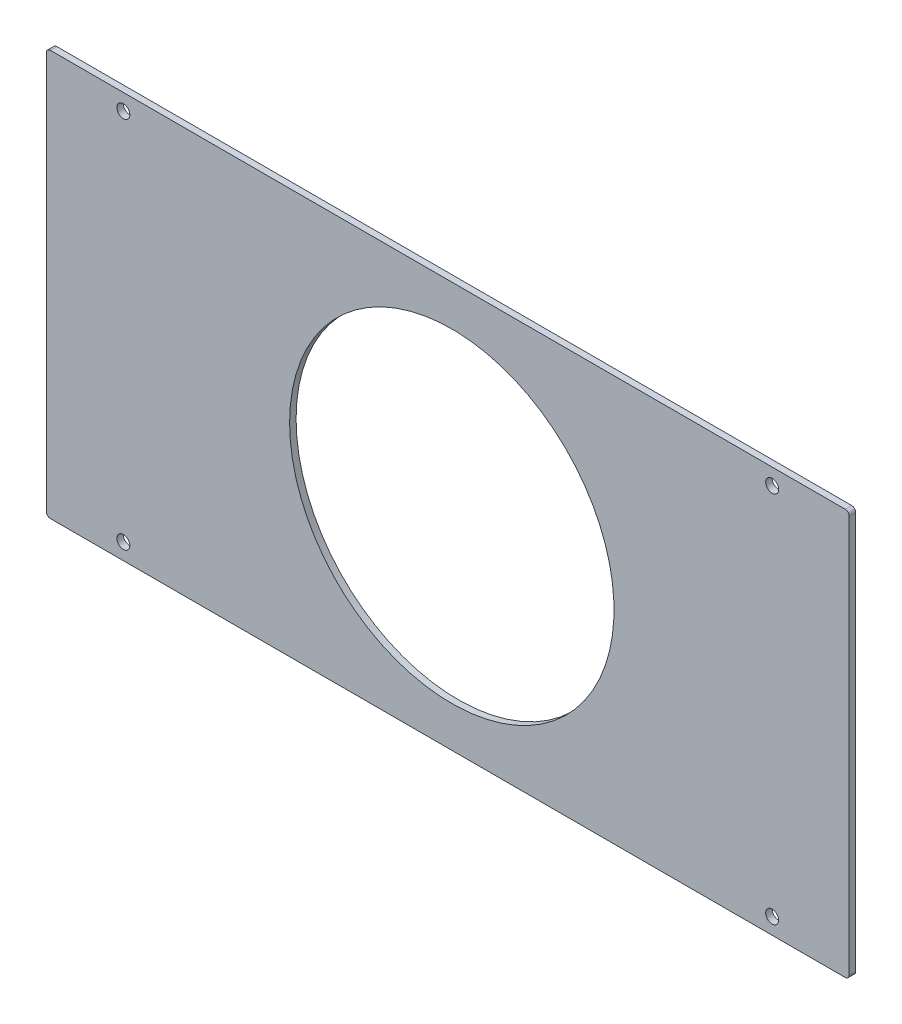
ISO-10303-21;
HEADER;
FILE_DESCRIPTION(('STEP AP214'),'2;1');
FILE_NAME('part.step','',(''),(''),'','','');
FILE_SCHEMA(('AUTOMOTIVE_DESIGN { 1 0 10303 214 1 1 1 1 }'));
ENDSEC;
DATA;
#1=APPLICATION_CONTEXT('core data for automotive mechanical design processes');
#2=APPLICATION_PROTOCOL_DEFINITION('international standard','automotive_design',2000,#1);
#3=PRODUCT_CONTEXT('',#1,'mechanical');
#4=PRODUCT('Part','Part','',(#3));
#5=PRODUCT_RELATED_PRODUCT_CATEGORY('part','',(#4));
#6=PRODUCT_DEFINITION_FORMATION('','',#4);
#7=PRODUCT_DEFINITION_CONTEXT('part definition',#1,'design');
#8=PRODUCT_DEFINITION('design','',#6,#7);
#9=PRODUCT_DEFINITION_SHAPE('','',#8);
#10=(LENGTH_UNIT() NAMED_UNIT(*) SI_UNIT(.MILLI.,.METRE.));
#11=(NAMED_UNIT(*) PLANE_ANGLE_UNIT() SI_UNIT($,.RADIAN.));
#12=(NAMED_UNIT(*) SI_UNIT($,.STERADIAN.) SOLID_ANGLE_UNIT());
#13=UNCERTAINTY_MEASURE_WITH_UNIT(LENGTH_MEASURE(1.E-05),#10,'distance_accuracy_value','');
#14=(GEOMETRIC_REPRESENTATION_CONTEXT(3) GLOBAL_UNCERTAINTY_ASSIGNED_CONTEXT((#13)) GLOBAL_UNIT_ASSIGNED_CONTEXT((#10,
#11,#12)) REPRESENTATION_CONTEXT('',''));
#15=CARTESIAN_POINT('',(0.,0.,0.));
#16=DIRECTION('',(0.,0.,1.));
#17=DIRECTION('',(1.,0.,0.));
#18=AXIS2_PLACEMENT_3D('',#15,#16,#17);
#19=CARTESIAN_POINT('',(197.,99.,1.6));
#20=DIRECTION('',(0.,0.,-1.));
#21=DIRECTION('',(-1.,0.,0.));
#22=AXIS2_PLACEMENT_3D('',#19,#20,#21);
#23=CYLINDRICAL_SURFACE('',#22,1.);
#24=CARTESIAN_POINT('',(197.,99.,0.));
#25=DIRECTION('',(0.,0.,1.));
#26=DIRECTION('',(-1.,0.,0.));
#27=AXIS2_PLACEMENT_3D('',#24,#25,#26);
#28=CIRCLE('',#27,1.);
#29=CARTESIAN_POINT('',(198.,99.,0.));
#30=VERTEX_POINT('',#29);
#31=CARTESIAN_POINT('',(197.,100.,0.));
#32=VERTEX_POINT('',#31);
#33=EDGE_CURVE('E132',#30,#32,#28,.T.);
#34=ORIENTED_EDGE('',*,*,#33,.T.);
#35=DIRECTION('',(0.,0.,-1.));
#36=VECTOR('',#35,1.);
#37=CARTESIAN_POINT('',(197.,100.,1.6));
#38=LINE('',#37,#36);
#39=CARTESIAN_POINT('',(197.,100.,1.6));
#40=VERTEX_POINT('',#39);
#41=EDGE_CURVE('E11',#40,#32,#38,.T.);
#42=ORIENTED_EDGE('',*,*,#41,.F.);
#43=CARTESIAN_POINT('',(197.,99.,1.6));
#44=DIRECTION('',(0.,0.,1.));
#45=DIRECTION('',(-1.,0.,0.));
#46=AXIS2_PLACEMENT_3D('',#43,#44,#45);
#47=CIRCLE('',#46,1.);
#48=CARTESIAN_POINT('',(198.,99.,1.6));
#49=VERTEX_POINT('',#48);
#50=EDGE_CURVE('E147',#49,#40,#47,.T.);
#51=ORIENTED_EDGE('',*,*,#50,.F.);
#52=DIRECTION('',(0.,0.,-1.));
#53=VECTOR('',#52,1.);
#54=CARTESIAN_POINT('',(198.,99.,1.6));
#55=LINE('',#54,#53);
#56=EDGE_CURVE('E128',#49,#30,#55,.T.);
#57=ORIENTED_EDGE('',*,*,#56,.T.);
#58=EDGE_LOOP('',(#34,#42,#51,#57));
#59=FACE_BOUND('',#58,.T.);
#60=ADVANCED_FACE('F36',(#59),#23,.T.);
#61=CARTESIAN_POINT('',(1.00000000000001,100.,1.6));
#62=DIRECTION('',(0.,-1.,0.));
#63=DIRECTION('',(0.,0.,-1.));
#64=AXIS2_PLACEMENT_3D('',#61,#62,#63);
#65=PLANE('',#64);
#66=DIRECTION('',(-1.,0.,0.));
#67=VECTOR('',#66,1.);
#68=CARTESIAN_POINT('',(1.00000000000001,100.,0.));
#69=LINE('',#68,#67);
#70=CARTESIAN_POINT('',(1.00000000000001,100.,0.));
#71=VERTEX_POINT('',#70);
#72=EDGE_CURVE('E135',#32,#71,#69,.T.);
#73=ORIENTED_EDGE('',*,*,#72,.T.);
#74=DIRECTION('',(0.,0.,-1.));
#75=VECTOR('',#74,1.);
#76=CARTESIAN_POINT('',(1.00000000000001,100.,1.6));
#77=LINE('',#76,#75);
#78=CARTESIAN_POINT('',(1.00000000000001,100.,1.6));
#79=VERTEX_POINT('',#78);
#80=EDGE_CURVE('E44',#79,#71,#77,.T.);
#81=ORIENTED_EDGE('',*,*,#80,.F.);
#82=DIRECTION('',(-1.,0.,0.));
#83=VECTOR('',#82,1.);
#84=CARTESIAN_POINT('',(1.00000000000001,100.,1.6));
#85=LINE('',#84,#83);
#86=EDGE_CURVE('E95',#40,#79,#85,.T.);
#87=ORIENTED_EDGE('',*,*,#86,.F.);
#88=ORIENTED_EDGE('',*,*,#41,.T.);
#89=EDGE_LOOP('',(#73,#81,#87,#88));
#90=FACE_BOUND('',#89,.T.);
#91=ADVANCED_FACE('F235',(#90),#65,.F.);
#92=CARTESIAN_POINT('',(1.,99.,1.6));
#93=DIRECTION('',(0.,0.,-1.));
#94=DIRECTION('',(-1.,0.,0.));
#95=AXIS2_PLACEMENT_3D('',#92,#93,#94);
#96=CYLINDRICAL_SURFACE('',#95,1.);
#97=CARTESIAN_POINT('',(1.,99.,0.));
#98=DIRECTION('',(0.,0.,1.));
#99=DIRECTION('',(-1.,0.,0.));
#100=AXIS2_PLACEMENT_3D('',#97,#98,#99);
#101=CIRCLE('',#100,1.);
#102=CARTESIAN_POINT('',(0.,99.,0.));
#103=VERTEX_POINT('',#102);
#104=EDGE_CURVE('E138',#71,#103,#101,.T.);
#105=ORIENTED_EDGE('',*,*,#104,.T.);
#106=DIRECTION('',(0.,0.,-1.));
#107=VECTOR('',#106,1.);
#108=CARTESIAN_POINT('',(0.,99.,1.6));
#109=LINE('',#108,#107);
#110=CARTESIAN_POINT('',(0.,99.,1.6));
#111=VERTEX_POINT('',#110);
#112=EDGE_CURVE('E154',#111,#103,#109,.T.);
#113=ORIENTED_EDGE('',*,*,#112,.F.);
#114=CARTESIAN_POINT('',(1.,99.,1.6));
#115=DIRECTION('',(0.,0.,1.));
#116=DIRECTION('',(-1.,0.,0.));
#117=AXIS2_PLACEMENT_3D('',#114,#115,#116);
#118=CIRCLE('',#117,1.);
#119=EDGE_CURVE('E162',#79,#111,#118,.T.);
#120=ORIENTED_EDGE('',*,*,#119,.F.);
#121=ORIENTED_EDGE('',*,*,#80,.T.);
#122=EDGE_LOOP('',(#105,#113,#120,#121));
#123=FACE_BOUND('',#122,.T.);
#124=ADVANCED_FACE('F160',(#123),#96,.T.);
#125=CARTESIAN_POINT('',(0.,1.00000000000001,1.6));
#126=DIRECTION('',(1.,0.,0.));
#127=DIRECTION('',(0.,0.,-1.));
#128=AXIS2_PLACEMENT_3D('',#125,#126,#127);
#129=PLANE('',#128);
#130=DIRECTION('',(0.,-1.,0.));
#131=VECTOR('',#130,1.);
#132=CARTESIAN_POINT('',(0.,1.00000000000001,0.));
#133=LINE('',#132,#131);
#134=CARTESIAN_POINT('',(0.,1.00000000000001,0.));
#135=VERTEX_POINT('',#134);
#136=EDGE_CURVE('E140',#103,#135,#133,.T.);
#137=ORIENTED_EDGE('',*,*,#136,.T.);
#138=DIRECTION('',(0.,0.,-1.));
#139=VECTOR('',#138,1.);
#140=CARTESIAN_POINT('',(0.,1.00000000000001,1.6));
#141=LINE('',#140,#139);
#142=CARTESIAN_POINT('',(0.,1.00000000000001,1.6));
#143=VERTEX_POINT('',#142);
#144=EDGE_CURVE('E151',#143,#135,#141,.T.);
#145=ORIENTED_EDGE('',*,*,#144,.F.);
#146=DIRECTION('',(0.,-1.,0.));
#147=VECTOR('',#146,1.);
#148=CARTESIAN_POINT('',(0.,1.00000000000001,1.6));
#149=LINE('',#148,#147);
#150=EDGE_CURVE('E174',#111,#143,#149,.T.);
#151=ORIENTED_EDGE('',*,*,#150,.F.);
#152=ORIENTED_EDGE('',*,*,#112,.T.);
#153=EDGE_LOOP('',(#137,#145,#151,#152));
#154=FACE_BOUND('',#153,.T.);
#155=ADVANCED_FACE('F170',(#154),#129,.F.);
#156=CARTESIAN_POINT('',(1.,1.,1.6));
#157=DIRECTION('',(0.,0.,-1.));
#158=DIRECTION('',(-1.,0.,0.));
#159=AXIS2_PLACEMENT_3D('',#156,#157,#158);
#160=CYLINDRICAL_SURFACE('',#159,1.);
#161=CARTESIAN_POINT('',(1.,1.,0.));
#162=DIRECTION('',(0.,0.,1.));
#163=DIRECTION('',(-1.,0.,0.));
#164=AXIS2_PLACEMENT_3D('',#161,#162,#163);
#165=CIRCLE('',#164,1.);
#166=CARTESIAN_POINT('',(1.00000000000001,0.,0.));
#167=VERTEX_POINT('',#166);
#168=EDGE_CURVE('E142',#135,#167,#165,.T.);
#169=ORIENTED_EDGE('',*,*,#168,.T.);
#170=DIRECTION('',(0.,0.,-1.));
#171=VECTOR('',#170,1.);
#172=CARTESIAN_POINT('',(1.00000000000001,0.,1.6));
#173=LINE('',#172,#171);
#174=CARTESIAN_POINT('',(1.00000000000001,0.,1.6));
#175=VERTEX_POINT('',#174);
#176=EDGE_CURVE('E123',#175,#167,#173,.T.);
#177=ORIENTED_EDGE('',*,*,#176,.F.);
#178=CARTESIAN_POINT('',(1.,1.,1.6));
#179=DIRECTION('',(0.,0.,1.));
#180=DIRECTION('',(-1.,0.,0.));
#181=AXIS2_PLACEMENT_3D('',#178,#179,#180);
#182=CIRCLE('',#181,1.);
#183=EDGE_CURVE('E114',#143,#175,#182,.T.);
#184=ORIENTED_EDGE('',*,*,#183,.F.);
#185=ORIENTED_EDGE('',*,*,#144,.T.);
#186=EDGE_LOOP('',(#169,#177,#184,#185));
#187=FACE_BOUND('',#186,.T.);
#188=ADVANCED_FACE('F173',(#187),#160,.T.);
#189=CARTESIAN_POINT('',(1.00000000000001,0.,1.6));
#190=DIRECTION('',(0.,1.,0.));
#191=DIRECTION('',(0.,0.,1.));
#192=AXIS2_PLACEMENT_3D('',#189,#190,#191);
#193=PLANE('',#192);
#194=DIRECTION('',(1.,0.,0.));
#195=VECTOR('',#194,1.);
#196=CARTESIAN_POINT('',(1.00000000000001,0.,0.));
#197=LINE('',#196,#195);
#198=CARTESIAN_POINT('',(197.,0.,0.));
#199=VERTEX_POINT('',#198);
#200=EDGE_CURVE('E122',#167,#199,#197,.T.);
#201=ORIENTED_EDGE('',*,*,#200,.T.);
#202=DIRECTION('',(0.,0.,-1.));
#203=VECTOR('',#202,1.);
#204=CARTESIAN_POINT('',(197.,0.,1.6));
#205=LINE('',#204,#203);
#206=CARTESIAN_POINT('',(197.,0.,1.6));
#207=VERTEX_POINT('',#206);
#208=EDGE_CURVE('E119',#207,#199,#205,.T.);
#209=ORIENTED_EDGE('',*,*,#208,.F.);
#210=DIRECTION('',(1.,0.,0.));
#211=VECTOR('',#210,1.);
#212=CARTESIAN_POINT('',(1.00000000000001,0.,1.6));
#213=LINE('',#212,#211);
#214=EDGE_CURVE('E108',#175,#207,#213,.T.);
#215=ORIENTED_EDGE('',*,*,#214,.F.);
#216=ORIENTED_EDGE('',*,*,#176,.T.);
#217=EDGE_LOOP('',(#201,#209,#215,#216));
#218=FACE_BOUND('',#217,.T.);
#219=ADVANCED_FACE('F120',(#218),#193,.F.);
#220=CARTESIAN_POINT('',(197.,1.,1.6));
#221=DIRECTION('',(0.,0.,-1.));
#222=DIRECTION('',(-1.,0.,0.));
#223=AXIS2_PLACEMENT_3D('',#220,#221,#222);
#224=CYLINDRICAL_SURFACE('',#223,1.);
#225=CARTESIAN_POINT('',(197.,1.,0.));
#226=DIRECTION('',(0.,0.,1.));
#227=DIRECTION('',(1.,0.,0.));
#228=AXIS2_PLACEMENT_3D('',#225,#226,#227);
#229=CIRCLE('',#228,1.);
#230=CARTESIAN_POINT('',(198.,1.,0.));
#231=VERTEX_POINT('',#230);
#232=EDGE_CURVE('E81',#199,#231,#229,.T.);
#233=ORIENTED_EDGE('',*,*,#232,.T.);
#234=DIRECTION('',(0.,0.,-1.));
#235=VECTOR('',#234,1.);
#236=CARTESIAN_POINT('',(198.,1.,1.6));
#237=LINE('',#236,#235);
#238=CARTESIAN_POINT('',(198.,1.,1.6));
#239=VERTEX_POINT('',#238);
#240=EDGE_CURVE('E124',#239,#231,#237,.T.);
#241=ORIENTED_EDGE('',*,*,#240,.F.);
#242=CARTESIAN_POINT('',(197.,1.,1.6));
#243=DIRECTION('',(0.,0.,1.));
#244=DIRECTION('',(1.,0.,0.));
#245=AXIS2_PLACEMENT_3D('',#242,#243,#244);
#246=CIRCLE('',#245,1.);
#247=EDGE_CURVE('E112',#207,#239,#246,.T.);
#248=ORIENTED_EDGE('',*,*,#247,.F.);
#249=ORIENTED_EDGE('',*,*,#208,.T.);
#250=EDGE_LOOP('',(#233,#241,#248,#249));
#251=FACE_BOUND('',#250,.T.);
#252=ADVANCED_FACE('F126',(#251),#224,.T.);
#253=CARTESIAN_POINT('',(198.,1.,1.6));
#254=DIRECTION('',(-1.,0.,0.));
#255=DIRECTION('',(0.,0.,1.));
#256=AXIS2_PLACEMENT_3D('',#253,#254,#255);
#257=PLANE('',#256);
#258=DIRECTION('',(0.,1.,0.));
#259=VECTOR('',#258,1.);
#260=CARTESIAN_POINT('',(198.,1.,0.));
#261=LINE('',#260,#259);
#262=EDGE_CURVE('E87',#231,#30,#261,.T.);
#263=ORIENTED_EDGE('',*,*,#262,.T.);
#264=ORIENTED_EDGE('',*,*,#56,.F.);
#265=DIRECTION('',(0.,1.,0.));
#266=VECTOR('',#265,1.);
#267=CARTESIAN_POINT('',(198.,1.,1.6));
#268=LINE('',#267,#266);
#269=EDGE_CURVE('E52',#239,#49,#268,.T.);
#270=ORIENTED_EDGE('',*,*,#269,.F.);
#271=ORIENTED_EDGE('',*,*,#240,.T.);
#272=EDGE_LOOP('',(#263,#264,#270,#271));
#273=FACE_BOUND('',#272,.T.);
#274=ADVANCED_FACE('F242',(#273),#257,.F.);
#275=CARTESIAN_POINT('',(197.,99.,1.6));
#276=DIRECTION('',(0.,0.,-1.));
#277=DIRECTION('',(-1.,0.,0.));
#278=AXIS2_PLACEMENT_3D('',#275,#276,#277);
#279=PLANE('',#278);
#280=CARTESIAN_POINT('',(100.,50.,1.6));
#281=DIRECTION('',(0.,0.,-1.));
#282=DIRECTION('',(-1.,0.,0.));
#283=AXIS2_PLACEMENT_3D('',#280,#281,#282);
#284=CIRCLE('',#283,40.);
#285=CARTESIAN_POINT('',(60.,50.,1.6));
#286=VERTEX_POINT('',#285);
#287=EDGE_CURVE('E189',#286,#286,#284,.T.);
#288=ORIENTED_EDGE('',*,*,#287,.T.);
#289=EDGE_LOOP('',(#288));
#290=FACE_BOUND('',#289,.T.);
#291=CARTESIAN_POINT('',(19.,96.,1.6));
#292=DIRECTION('',(0.,0.,-1.));
#293=DIRECTION('',(-1.,0.,0.));
#294=AXIS2_PLACEMENT_3D('',#291,#292,#293);
#295=CIRCLE('',#294,1.60000000000001);
#296=CARTESIAN_POINT('',(17.4,96.,1.6));
#297=VERTEX_POINT('',#296);
#298=EDGE_CURVE('E195',#297,#297,#295,.T.);
#299=ORIENTED_EDGE('',*,*,#298,.T.);
#300=EDGE_LOOP('',(#299));
#301=FACE_BOUND('',#300,.T.);
#302=CARTESIAN_POINT('',(19.,4.,1.6));
#303=DIRECTION('',(0.,0.,-1.));
#304=DIRECTION('',(-1.,0.,0.));
#305=AXIS2_PLACEMENT_3D('',#302,#303,#304);
#306=CIRCLE('',#305,1.6);
#307=CARTESIAN_POINT('',(17.4,4.,1.6));
#308=VERTEX_POINT('',#307);
#309=EDGE_CURVE('E201',#308,#308,#306,.T.);
#310=ORIENTED_EDGE('',*,*,#309,.T.);
#311=EDGE_LOOP('',(#310));
#312=FACE_BOUND('',#311,.T.);
#313=CARTESIAN_POINT('',(179.,4.,1.6));
#314=DIRECTION('',(0.,0.,-1.));
#315=DIRECTION('',(-1.,0.,0.));
#316=AXIS2_PLACEMENT_3D('',#313,#314,#315);
#317=CIRCLE('',#316,1.59999999999999);
#318=CARTESIAN_POINT('',(177.4,4.,1.6));
#319=VERTEX_POINT('',#318);
#320=EDGE_CURVE('E183',#319,#319,#317,.T.);
#321=ORIENTED_EDGE('',*,*,#320,.T.);
#322=EDGE_LOOP('',(#321));
#323=FACE_BOUND('',#322,.T.);
#324=CARTESIAN_POINT('',(179.,96.,1.6));
#325=DIRECTION('',(0.,0.,-1.));
#326=DIRECTION('',(-1.,0.,0.));
#327=AXIS2_PLACEMENT_3D('',#324,#325,#326);
#328=CIRCLE('',#327,1.59999999999999);
#329=CARTESIAN_POINT('',(177.4,96.,1.6));
#330=VERTEX_POINT('',#329);
#331=EDGE_CURVE('E136',#330,#330,#328,.T.);
#332=ORIENTED_EDGE('',*,*,#331,.T.);
#333=EDGE_LOOP('',(#332));
#334=FACE_BOUND('',#333,.T.);
#335=ORIENTED_EDGE('',*,*,#50,.T.);
#336=ORIENTED_EDGE('',*,*,#86,.T.);
#337=ORIENTED_EDGE('',*,*,#119,.T.);
#338=ORIENTED_EDGE('',*,*,#150,.T.);
#339=ORIENTED_EDGE('',*,*,#183,.T.);
#340=ORIENTED_EDGE('',*,*,#214,.T.);
#341=ORIENTED_EDGE('',*,*,#247,.T.);
#342=ORIENTED_EDGE('',*,*,#269,.T.);
#343=EDGE_LOOP('',(#335,#336,#337,#338,#339,#340,#341,#342));
#344=FACE_BOUND('',#343,.T.);
#345=ADVANCED_FACE('F110',(#290,#301,#312,#323,#334,#344),#279,.F.);
#346=CARTESIAN_POINT('',(197.,99.,0.));
#347=DIRECTION('',(0.,0.,-1.));
#348=DIRECTION('',(-1.,0.,0.));
#349=AXIS2_PLACEMENT_3D('',#346,#347,#348);
#350=PLANE('',#349);
#351=CARTESIAN_POINT('',(100.,50.,0.));
#352=DIRECTION('',(0.,0.,-1.));
#353=DIRECTION('',(-1.,0.,0.));
#354=AXIS2_PLACEMENT_3D('',#351,#352,#353);
#355=CIRCLE('',#354,40.);
#356=CARTESIAN_POINT('',(60.,50.,0.));
#357=VERTEX_POINT('',#356);
#358=EDGE_CURVE('E186',#357,#357,#355,.T.);
#359=ORIENTED_EDGE('',*,*,#358,.F.);
#360=EDGE_LOOP('',(#359));
#361=FACE_BOUND('',#360,.T.);
#362=CARTESIAN_POINT('',(19.,96.,0.));
#363=DIRECTION('',(0.,0.,-1.));
#364=DIRECTION('',(-1.,0.,0.));
#365=AXIS2_PLACEMENT_3D('',#362,#363,#364);
#366=CIRCLE('',#365,1.60000000000001);
#367=CARTESIAN_POINT('',(17.4,96.,0.));
#368=VERTEX_POINT('',#367);
#369=EDGE_CURVE('E192',#368,#368,#366,.T.);
#370=ORIENTED_EDGE('',*,*,#369,.F.);
#371=EDGE_LOOP('',(#370));
#372=FACE_BOUND('',#371,.T.);
#373=CARTESIAN_POINT('',(19.,4.,0.));
#374=DIRECTION('',(0.,0.,-1.));
#375=DIRECTION('',(-1.,0.,0.));
#376=AXIS2_PLACEMENT_3D('',#373,#374,#375);
#377=CIRCLE('',#376,1.6);
#378=CARTESIAN_POINT('',(17.4,4.,0.));
#379=VERTEX_POINT('',#378);
#380=EDGE_CURVE('E198',#379,#379,#377,.T.);
#381=ORIENTED_EDGE('',*,*,#380,.F.);
#382=EDGE_LOOP('',(#381));
#383=FACE_BOUND('',#382,.T.);
#384=CARTESIAN_POINT('',(179.,4.,0.));
#385=DIRECTION('',(0.,0.,-1.));
#386=DIRECTION('',(-1.,0.,0.));
#387=AXIS2_PLACEMENT_3D('',#384,#385,#386);
#388=CIRCLE('',#387,1.59999999999999);
#389=CARTESIAN_POINT('',(177.4,4.,0.));
#390=VERTEX_POINT('',#389);
#391=EDGE_CURVE('E204',#390,#390,#388,.T.);
#392=ORIENTED_EDGE('',*,*,#391,.F.);
#393=EDGE_LOOP('',(#392));
#394=FACE_BOUND('',#393,.T.);
#395=CARTESIAN_POINT('',(179.,96.,0.));
#396=DIRECTION('',(0.,0.,-1.));
#397=DIRECTION('',(-1.,0.,0.));
#398=AXIS2_PLACEMENT_3D('',#395,#396,#397);
#399=CIRCLE('',#398,1.59999999999999);
#400=CARTESIAN_POINT('',(177.4,96.,0.));
#401=VERTEX_POINT('',#400);
#402=EDGE_CURVE('E180',#401,#401,#399,.T.);
#403=ORIENTED_EDGE('',*,*,#402,.F.);
#404=EDGE_LOOP('',(#403));
#405=FACE_BOUND('',#404,.T.);
#406=ORIENTED_EDGE('',*,*,#33,.F.);
#407=ORIENTED_EDGE('',*,*,#262,.F.);
#408=ORIENTED_EDGE('',*,*,#232,.F.);
#409=ORIENTED_EDGE('',*,*,#200,.F.);
#410=ORIENTED_EDGE('',*,*,#168,.F.);
#411=ORIENTED_EDGE('',*,*,#136,.F.);
#412=ORIENTED_EDGE('',*,*,#104,.F.);
#413=ORIENTED_EDGE('',*,*,#72,.F.);
#414=EDGE_LOOP('',(#406,#407,#408,#409,#410,#411,#412,#413));
#415=FACE_BOUND('',#414,.T.);
#416=ADVANCED_FACE('F166',(#361,#372,#383,#394,#405,#415),#350,.T.);
#417=CARTESIAN_POINT('',(179.,96.,1.6));
#418=DIRECTION('',(0.,0.,-1.));
#419=DIRECTION('',(-1.,0.,0.));
#420=AXIS2_PLACEMENT_3D('',#417,#418,#419);
#421=CYLINDRICAL_SURFACE('',#420,1.59999999999999);
#422=ORIENTED_EDGE('',*,*,#331,.F.);
#423=EDGE_LOOP('',(#422));
#424=FACE_BOUND('',#423,.T.);
#425=ORIENTED_EDGE('',*,*,#402,.T.);
#426=EDGE_LOOP('',(#425));
#427=FACE_BOUND('',#426,.T.);
#428=ADVANCED_FACE('F216',(#424,#427),#421,.F.);
#429=CARTESIAN_POINT('',(179.,4.,1.6));
#430=DIRECTION('',(0.,0.,-1.));
#431=DIRECTION('',(-1.,0.,0.));
#432=AXIS2_PLACEMENT_3D('',#429,#430,#431);
#433=CYLINDRICAL_SURFACE('',#432,1.59999999999999);
#434=ORIENTED_EDGE('',*,*,#320,.F.);
#435=EDGE_LOOP('',(#434));
#436=FACE_BOUND('',#435,.T.);
#437=ORIENTED_EDGE('',*,*,#391,.T.);
#438=EDGE_LOOP('',(#437));
#439=FACE_BOUND('',#438,.T.);
#440=ADVANCED_FACE('F212',(#436,#439),#433,.F.);
#441=CARTESIAN_POINT('',(19.,4.,1.6));
#442=DIRECTION('',(0.,0.,-1.));
#443=DIRECTION('',(-1.,0.,0.));
#444=AXIS2_PLACEMENT_3D('',#441,#442,#443);
#445=CYLINDRICAL_SURFACE('',#444,1.6);
#446=ORIENTED_EDGE('',*,*,#309,.F.);
#447=EDGE_LOOP('',(#446));
#448=FACE_BOUND('',#447,.T.);
#449=ORIENTED_EDGE('',*,*,#380,.T.);
#450=EDGE_LOOP('',(#449));
#451=FACE_BOUND('',#450,.T.);
#452=ADVANCED_FACE('F215',(#448,#451),#445,.F.);
#453=CARTESIAN_POINT('',(19.,96.,1.6));
#454=DIRECTION('',(0.,0.,-1.));
#455=DIRECTION('',(-1.,0.,0.));
#456=AXIS2_PLACEMENT_3D('',#453,#454,#455);
#457=CYLINDRICAL_SURFACE('',#456,1.60000000000001);
#458=ORIENTED_EDGE('',*,*,#298,.F.);
#459=EDGE_LOOP('',(#458));
#460=FACE_BOUND('',#459,.T.);
#461=ORIENTED_EDGE('',*,*,#369,.T.);
#462=EDGE_LOOP('',(#461));
#463=FACE_BOUND('',#462,.T.);
#464=ADVANCED_FACE('F314',(#460,#463),#457,.F.);
#465=CARTESIAN_POINT('',(100.,50.,1.6));
#466=DIRECTION('',(0.,0.,-1.));
#467=DIRECTION('',(-1.,0.,0.));
#468=AXIS2_PLACEMENT_3D('',#465,#466,#467);
#469=CYLINDRICAL_SURFACE('',#468,40.);
#470=ORIENTED_EDGE('',*,*,#287,.F.);
#471=EDGE_LOOP('',(#470));
#472=FACE_BOUND('',#471,.T.);
#473=ORIENTED_EDGE('',*,*,#358,.T.);
#474=EDGE_LOOP('',(#473));
#475=FACE_BOUND('',#474,.T.);
#476=ADVANCED_FACE('F324',(#472,#475),#469,.F.);
#477=CLOSED_SHELL('',(#60,#91,#124,#155,#188,#219,#252,#274,#345,#416,#428,#440,#452,#464,#476));
#478=MANIFOLD_SOLID_BREP('B2',#477);
#479=ADVANCED_BREP_SHAPE_REPRESENTATION('',(#18,#478),#14);
#480=SHAPE_DEFINITION_REPRESENTATION(#9,#479);
ENDSEC;
END-ISO-10303-21;
